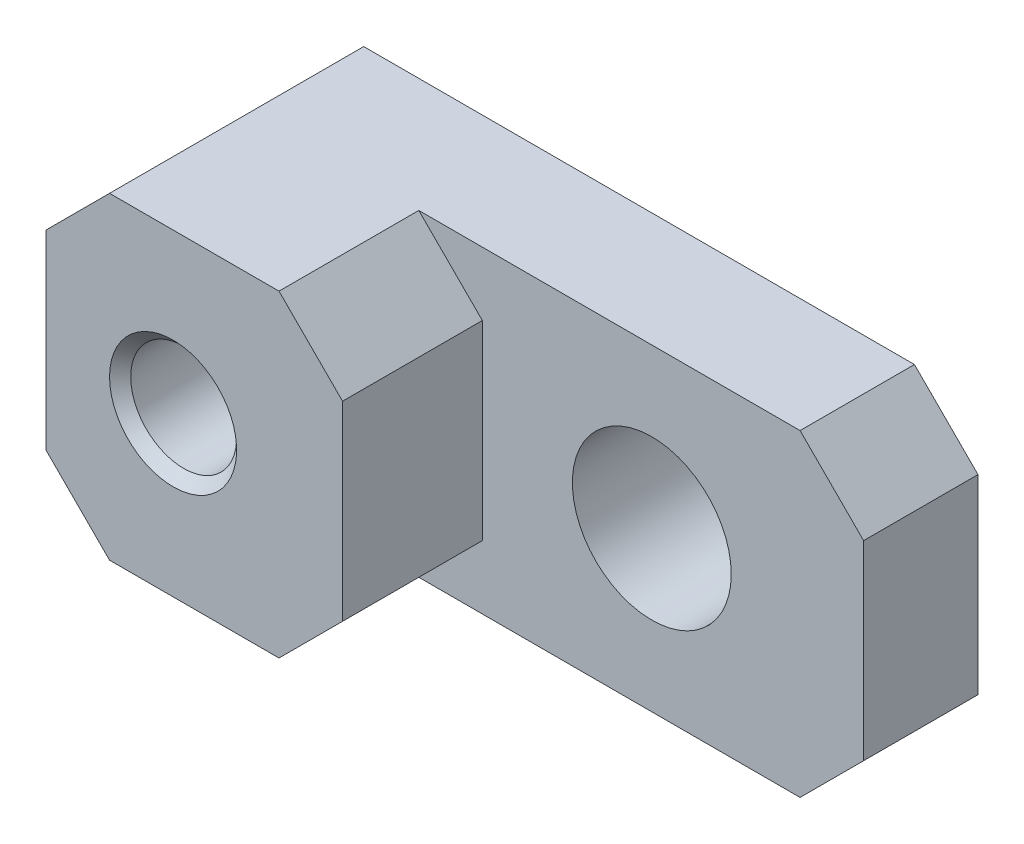
ISO-10303-21;
HEADER;
FILE_DESCRIPTION(('STEP AP214'),'2;1');
FILE_NAME('part.step','',(''),(''),'','','');
FILE_SCHEMA(('AUTOMOTIVE_DESIGN { 1 0 10303 214 1 1 1 1 }'));
ENDSEC;
DATA;
#1=APPLICATION_CONTEXT('core data for automotive mechanical design processes');
#2=APPLICATION_PROTOCOL_DEFINITION('international standard','automotive_design',2000,#1);
#3=PRODUCT_CONTEXT('',#1,'mechanical');
#4=PRODUCT('Part','Part','',(#3));
#5=PRODUCT_RELATED_PRODUCT_CATEGORY('part','',(#4));
#6=PRODUCT_DEFINITION_FORMATION('','',#4);
#7=PRODUCT_DEFINITION_CONTEXT('part definition',#1,'design');
#8=PRODUCT_DEFINITION('design','',#6,#7);
#9=PRODUCT_DEFINITION_SHAPE('','',#8);
#10=(LENGTH_UNIT() NAMED_UNIT(*) SI_UNIT(.MILLI.,.METRE.));
#11=(NAMED_UNIT(*) PLANE_ANGLE_UNIT() SI_UNIT($,.RADIAN.));
#12=(NAMED_UNIT(*) SI_UNIT($,.STERADIAN.) SOLID_ANGLE_UNIT());
#13=UNCERTAINTY_MEASURE_WITH_UNIT(LENGTH_MEASURE(1.E-05),#10,'distance_accuracy_value','');
#14=(GEOMETRIC_REPRESENTATION_CONTEXT(3) GLOBAL_UNCERTAINTY_ASSIGNED_CONTEXT((#13)) GLOBAL_UNIT_ASSIGNED_CONTEXT((#10,
#11,#12)) REPRESENTATION_CONTEXT('',''));
#15=CARTESIAN_POINT('',(0.,0.,0.));
#16=DIRECTION('',(0.,0.,1.));
#17=DIRECTION('',(1.,0.,0.));
#18=AXIS2_PLACEMENT_3D('',#15,#16,#17);
#19=CARTESIAN_POINT('',(20.32,0.,7.62));
#20=DIRECTION('',(-1.,0.,0.));
#21=DIRECTION('',(0.,0.,1.));
#22=AXIS2_PLACEMENT_3D('',#19,#20,#21);
#23=PLANE('',#22);
#24=DIRECTION('',(0.,1.,0.));
#25=VECTOR('',#24,1.);
#26=CARTESIAN_POINT('',(20.32,0.,0.));
#27=LINE('',#26,#25);
#28=CARTESIAN_POINT('',(20.32,1.905,0.));
#29=VERTEX_POINT('',#28);
#30=CARTESIAN_POINT('',(20.32,7.62,0.));
#31=VERTEX_POINT('',#30);
#32=EDGE_CURVE('E176',#29,#31,#27,.T.);
#33=ORIENTED_EDGE('',*,*,#32,.T.);
#34=DIRECTION('',(0.,0.,1.));
#35=VECTOR('',#34,1.);
#36=CARTESIAN_POINT('',(20.32,7.62,7.62));
#37=LINE('',#36,#35);
#38=CARTESIAN_POINT('',(20.32,7.62000000000001,3.429));
#39=VERTEX_POINT('',#38);
#40=EDGE_CURVE('E47',#31,#39,#37,.T.);
#41=ORIENTED_EDGE('',*,*,#40,.T.);
#42=DIRECTION('',(0.,1.,0.));
#43=VECTOR('',#42,1.);
#44=CARTESIAN_POINT('',(20.32,0.,3.429));
#45=LINE('',#44,#43);
#46=CARTESIAN_POINT('',(20.32,1.905,3.429));
#47=VERTEX_POINT('',#46);
#48=EDGE_CURVE('E139',#47,#39,#45,.T.);
#49=ORIENTED_EDGE('',*,*,#48,.F.);
#50=DIRECTION('',(0.,0.,-1.));
#51=VECTOR('',#50,1.);
#52=CARTESIAN_POINT('',(20.32,1.905,7.62));
#53=LINE('',#52,#51);
#54=EDGE_CURVE('E145',#47,#29,#53,.T.);
#55=ORIENTED_EDGE('',*,*,#54,.T.);
#56=EDGE_LOOP('',(#33,#41,#49,#55));
#57=FACE_BOUND('',#56,.T.);
#58=ADVANCED_FACE('F32',(#57),#23,.F.);
#59=CARTESIAN_POINT('',(13.97,4.7625,7.62));
#60=DIRECTION('',(0.,0.,1.));
#61=DIRECTION('',(1.,0.,0.));
#62=AXIS2_PLACEMENT_3D('',#59,#60,#61);
#63=CYLINDRICAL_SURFACE('',#62,2.38125);
#64=CARTESIAN_POINT('',(13.97,4.7625,0.));
#65=DIRECTION('',(0.,0.,1.));
#66=DIRECTION('',(1.,0.,0.));
#67=AXIS2_PLACEMENT_3D('',#64,#65,#66);
#68=CIRCLE('',#67,2.38125);
#69=CARTESIAN_POINT('',(16.35125,4.7625,0.));
#70=VERTEX_POINT('',#69);
#71=EDGE_CURVE('E174',#70,#70,#68,.T.);
#72=ORIENTED_EDGE('',*,*,#71,.F.);
#73=EDGE_LOOP('',(#72));
#74=FACE_BOUND('',#73,.T.);
#75=CARTESIAN_POINT('',(13.97,4.7625,3.429));
#76=DIRECTION('',(0.,0.,1.));
#77=DIRECTION('',(1.,0.,0.));
#78=AXIS2_PLACEMENT_3D('',#75,#76,#77);
#79=CIRCLE('',#78,2.38125);
#80=CARTESIAN_POINT('',(16.35125,4.7625,3.429));
#81=VERTEX_POINT('',#80);
#82=EDGE_CURVE('E179',#81,#81,#79,.F.);
#83=ORIENTED_EDGE('',*,*,#82,.F.);
#84=EDGE_LOOP('',(#83));
#85=FACE_BOUND('',#84,.T.);
#86=ADVANCED_FACE('F258',(#74,#85),#63,.F.);
#87=CARTESIAN_POINT('',(0.,0.,7.62));
#88=DIRECTION('',(1.,0.,0.));
#89=DIRECTION('',(0.,0.,-1.));
#90=AXIS2_PLACEMENT_3D('',#87,#88,#89);
#91=PLANE('',#90);
#92=DIRECTION('',(0.,-1.,0.));
#93=VECTOR('',#92,1.);
#94=CARTESIAN_POINT('',(0.,0.,7.62));
#95=LINE('',#94,#93);
#96=CARTESIAN_POINT('',(0.,7.62,7.62));
#97=VERTEX_POINT('',#96);
#98=CARTESIAN_POINT('',(0.,1.90500000000001,7.62));
#99=VERTEX_POINT('',#98);
#100=EDGE_CURVE('E165',#97,#99,#95,.T.);
#101=ORIENTED_EDGE('',*,*,#100,.F.);
#102=DIRECTION('',(0.,0.,-1.));
#103=VECTOR('',#102,1.);
#104=CARTESIAN_POINT('',(0.,7.62,7.62));
#105=LINE('',#104,#103);
#106=CARTESIAN_POINT('',(0.,7.62,0.));
#107=VERTEX_POINT('',#106);
#108=EDGE_CURVE('E154',#97,#107,#105,.T.);
#109=ORIENTED_EDGE('',*,*,#108,.T.);
#110=DIRECTION('',(0.,-1.,0.));
#111=VECTOR('',#110,1.);
#112=CARTESIAN_POINT('',(0.,0.,0.));
#113=LINE('',#112,#111);
#114=CARTESIAN_POINT('',(0.,1.90500000000001,0.));
#115=VERTEX_POINT('',#114);
#116=EDGE_CURVE('E162',#107,#115,#113,.T.);
#117=ORIENTED_EDGE('',*,*,#116,.T.);
#118=DIRECTION('',(0.,0.,1.));
#119=VECTOR('',#118,1.);
#120=CARTESIAN_POINT('',(0.,1.90500000000001,7.62));
#121=LINE('',#120,#119);
#122=EDGE_CURVE('E148',#115,#99,#121,.T.);
#123=ORIENTED_EDGE('',*,*,#122,.T.);
#124=EDGE_LOOP('',(#101,#109,#117,#123));
#125=FACE_BOUND('',#124,.T.);
#126=ADVANCED_FACE('F161',(#125),#91,.F.);
#127=CARTESIAN_POINT('',(0.,0.,7.62));
#128=DIRECTION('',(0.,1.,0.));
#129=DIRECTION('',(0.,0.,1.));
#130=AXIS2_PLACEMENT_3D('',#127,#128,#129);
#131=PLANE('',#130);
#132=DIRECTION('',(1.,0.,0.));
#133=VECTOR('',#132,1.);
#134=CARTESIAN_POINT('',(8.89,0.,3.429));
#135=LINE('',#134,#133);
#136=CARTESIAN_POINT('',(6.985,0.,3.429));
#137=VERTEX_POINT('',#136);
#138=CARTESIAN_POINT('',(18.415,0.,3.429));
#139=VERTEX_POINT('',#138);
#140=EDGE_CURVE('E125',#137,#139,#135,.T.);
#141=ORIENTED_EDGE('',*,*,#140,.F.);
#142=DIRECTION('',(0.,0.,1.));
#143=VECTOR('',#142,1.);
#144=CARTESIAN_POINT('',(6.985,0.,7.62));
#145=LINE('',#144,#143);
#146=CARTESIAN_POINT('',(6.985,0.,7.62));
#147=VERTEX_POINT('',#146);
#148=EDGE_CURVE('E131',#137,#147,#145,.T.);
#149=ORIENTED_EDGE('',*,*,#148,.T.);
#150=DIRECTION('',(1.,0.,0.));
#151=VECTOR('',#150,1.);
#152=CARTESIAN_POINT('',(0.,0.,7.62));
#153=LINE('',#152,#151);
#154=CARTESIAN_POINT('',(1.905,0.,7.62));
#155=VERTEX_POINT('',#154);
#156=EDGE_CURVE('E241',#155,#147,#153,.T.);
#157=ORIENTED_EDGE('',*,*,#156,.F.);
#158=DIRECTION('',(0.,0.,-1.));
#159=VECTOR('',#158,1.);
#160=CARTESIAN_POINT('',(1.905,0.,7.62));
#161=LINE('',#160,#159);
#162=CARTESIAN_POINT('',(1.905,0.,0.));
#163=VERTEX_POINT('',#162);
#164=EDGE_CURVE('E132',#155,#163,#161,.T.);
#165=ORIENTED_EDGE('',*,*,#164,.T.);
#166=DIRECTION('',(1.,0.,0.));
#167=VECTOR('',#166,1.);
#168=CARTESIAN_POINT('',(0.,0.,0.));
#169=LINE('',#168,#167);
#170=CARTESIAN_POINT('',(18.415,0.,0.));
#171=VERTEX_POINT('',#170);
#172=EDGE_CURVE('E129',#163,#171,#169,.T.);
#173=ORIENTED_EDGE('',*,*,#172,.T.);
#174=DIRECTION('',(0.,0.,1.));
#175=VECTOR('',#174,1.);
#176=CARTESIAN_POINT('',(18.415,0.,7.62));
#177=LINE('',#176,#175);
#178=EDGE_CURVE('E122',#171,#139,#177,.T.);
#179=ORIENTED_EDGE('',*,*,#178,.T.);
#180=EDGE_LOOP('',(#141,#149,#157,#165,#173,#179));
#181=FACE_BOUND('',#180,.T.);
#182=ADVANCED_FACE('F123',(#181),#131,.F.);
#183=CARTESIAN_POINT('',(0.,9.525,7.62));
#184=DIRECTION('',(0.,-1.,0.));
#185=DIRECTION('',(0.,0.,-1.));
#186=AXIS2_PLACEMENT_3D('',#183,#184,#185);
#187=PLANE('',#186);
#188=DIRECTION('',(-1.,0.,0.));
#189=VECTOR('',#188,1.);
#190=CARTESIAN_POINT('',(0.,9.525,7.62));
#191=LINE('',#190,#189);
#192=CARTESIAN_POINT('',(6.98499999999999,9.525,7.62));
#193=VERTEX_POINT('',#192);
#194=CARTESIAN_POINT('',(1.90500000000001,9.525,7.62));
#195=VERTEX_POINT('',#194);
#196=EDGE_CURVE('E182',#193,#195,#191,.T.);
#197=ORIENTED_EDGE('',*,*,#196,.F.);
#198=DIRECTION('',(0.,0.,-1.));
#199=VECTOR('',#198,1.);
#200=CARTESIAN_POINT('',(6.98499999999999,9.525,7.62));
#201=LINE('',#200,#199);
#202=CARTESIAN_POINT('',(6.98499999999999,9.525,3.429));
#203=VERTEX_POINT('',#202);
#204=EDGE_CURVE('E210',#193,#203,#201,.T.);
#205=ORIENTED_EDGE('',*,*,#204,.T.);
#206=DIRECTION('',(-1.,0.,0.));
#207=VECTOR('',#206,1.);
#208=CARTESIAN_POINT('',(20.32,9.525,3.429));
#209=LINE('',#208,#207);
#210=CARTESIAN_POINT('',(18.415,9.525,3.429));
#211=VERTEX_POINT('',#210);
#212=EDGE_CURVE('E228',#211,#203,#209,.T.);
#213=ORIENTED_EDGE('',*,*,#212,.F.);
#214=DIRECTION('',(0.,0.,-1.));
#215=VECTOR('',#214,1.);
#216=CARTESIAN_POINT('',(18.415,9.525,7.62));
#217=LINE('',#216,#215);
#218=CARTESIAN_POINT('',(18.415,9.525,0.));
#219=VERTEX_POINT('',#218);
#220=EDGE_CURVE('E207',#211,#219,#217,.T.);
#221=ORIENTED_EDGE('',*,*,#220,.T.);
#222=DIRECTION('',(-1.,0.,0.));
#223=VECTOR('',#222,1.);
#224=CARTESIAN_POINT('',(0.,9.525,0.));
#225=LINE('',#224,#223);
#226=CARTESIAN_POINT('',(1.90500000000001,9.525,0.));
#227=VERTEX_POINT('',#226);
#228=EDGE_CURVE('E186',#219,#227,#225,.T.);
#229=ORIENTED_EDGE('',*,*,#228,.T.);
#230=DIRECTION('',(0.,0.,1.));
#231=VECTOR('',#230,1.);
#232=CARTESIAN_POINT('',(1.90500000000001,9.525,7.62));
#233=LINE('',#232,#231);
#234=EDGE_CURVE('E205',#227,#195,#233,.T.);
#235=ORIENTED_EDGE('',*,*,#234,.T.);
#236=EDGE_LOOP('',(#197,#205,#213,#221,#229,#235));
#237=FACE_BOUND('',#236,.T.);
#238=ADVANCED_FACE('F226',(#237),#187,.F.);
#239=CARTESIAN_POINT('',(0.,9.525,7.62));
#240=DIRECTION('',(0.,0.,-1.));
#241=DIRECTION('',(-1.,0.,0.));
#242=AXIS2_PLACEMENT_3D('',#239,#240,#241);
#243=PLANE('',#242);
#244=CARTESIAN_POINT('',(3.81,4.7625,7.62));
#245=DIRECTION('',(0.,0.,-1.));
#246=DIRECTION('',(-1.,0.,0.));
#247=AXIS2_PLACEMENT_3D('',#244,#245,#246);
#248=CIRCLE('',#247,1.905);
#249=CARTESIAN_POINT('',(1.905,4.7625,7.62));
#250=VERTEX_POINT('',#249);
#251=EDGE_CURVE('E235',#250,#250,#248,.T.);
#252=ORIENTED_EDGE('',*,*,#251,.T.);
#253=EDGE_LOOP('',(#252));
#254=FACE_BOUND('',#253,.T.);
#255=ORIENTED_EDGE('',*,*,#156,.T.);
#256=DIRECTION('',(-0.707106781186546,-0.707106781186549,0.));
#257=VECTOR('',#256,1.);
#258=CARTESIAN_POINT('',(6.985,0.,7.62));
#259=LINE('',#258,#257);
#260=CARTESIAN_POINT('',(8.89,1.90500000000001,7.62));
#261=VERTEX_POINT('',#260);
#262=EDGE_CURVE('E198',#147,#261,#259,.F.);
#263=ORIENTED_EDGE('',*,*,#262,.T.);
#264=DIRECTION('',(0.,-1.,0.));
#265=VECTOR('',#264,1.);
#266=CARTESIAN_POINT('',(8.89,9.525,7.62));
#267=LINE('',#266,#265);
#268=CARTESIAN_POINT('',(8.89,7.62,7.62));
#269=VERTEX_POINT('',#268);
#270=EDGE_CURVE('E231',#269,#261,#267,.T.);
#271=ORIENTED_EDGE('',*,*,#270,.F.);
#272=DIRECTION('',(0.707106781186549,-0.707106781186546,0.));
#273=VECTOR('',#272,1.);
#274=CARTESIAN_POINT('',(8.89,7.62,7.62));
#275=LINE('',#274,#273);
#276=EDGE_CURVE('E196',#269,#193,#275,.F.);
#277=ORIENTED_EDGE('',*,*,#276,.T.);
#278=ORIENTED_EDGE('',*,*,#196,.T.);
#279=DIRECTION('',(0.707106781186549,0.707106781186546,0.));
#280=VECTOR('',#279,1.);
#281=CARTESIAN_POINT('',(0.,7.62,7.62));
#282=LINE('',#281,#280);
#283=EDGE_CURVE('E194',#195,#97,#282,.F.);
#284=ORIENTED_EDGE('',*,*,#283,.T.);
#285=ORIENTED_EDGE('',*,*,#100,.T.);
#286=DIRECTION('',(-0.707106781186546,0.707106781186549,0.));
#287=VECTOR('',#286,1.);
#288=CARTESIAN_POINT('',(1.905,0.,7.62));
#289=LINE('',#288,#287);
#290=EDGE_CURVE('E192',#99,#155,#289,.F.);
#291=ORIENTED_EDGE('',*,*,#290,.T.);
#292=EDGE_LOOP('',(#255,#263,#271,#277,#278,#284,#285,#291));
#293=FACE_BOUND('',#292,.T.);
#294=ADVANCED_FACE('F246',(#254,#293),#243,.F.);
#295=CARTESIAN_POINT('',(0.,9.525,0.));
#296=DIRECTION('',(0.,0.,-1.));
#297=DIRECTION('',(-1.,0.,0.));
#298=AXIS2_PLACEMENT_3D('',#295,#296,#297);
#299=PLANE('',#298);
#300=CARTESIAN_POINT('',(3.81,4.7625,0.));
#301=DIRECTION('',(0.,0.,-1.));
#302=DIRECTION('',(-1.,0.,0.));
#303=AXIS2_PLACEMENT_3D('',#300,#301,#302);
#304=CIRCLE('',#303,1.905);
#305=CARTESIAN_POINT('',(1.905,4.7625,0.));
#306=VERTEX_POINT('',#305);
#307=EDGE_CURVE('E439',#306,#306,#304,.T.);
#308=ORIENTED_EDGE('',*,*,#307,.F.);
#309=EDGE_LOOP('',(#308));
#310=FACE_BOUND('',#309,.T.);
#311=ORIENTED_EDGE('',*,*,#71,.T.);
#312=EDGE_LOOP('',(#311));
#313=FACE_BOUND('',#312,.T.);
#314=ORIENTED_EDGE('',*,*,#228,.F.);
#315=DIRECTION('',(-0.707106781186547,0.707106781186548,0.));
#316=VECTOR('',#315,1.);
#317=CARTESIAN_POINT('',(9.20750000000002,18.7325,0.));
#318=LINE('',#317,#316);
#319=EDGE_CURVE('E217',#219,#31,#318,.F.);
#320=ORIENTED_EDGE('',*,*,#319,.T.);
#321=ORIENTED_EDGE('',*,*,#32,.F.);
#322=DIRECTION('',(0.70710678118655,0.707106781186545,0.));
#323=VECTOR('',#322,1.);
#324=CARTESIAN_POINT('',(13.9699999999999,-4.44500000000002,0.));
#325=LINE('',#324,#323);
#326=EDGE_CURVE('E215',#29,#171,#325,.F.);
#327=ORIENTED_EDGE('',*,*,#326,.T.);
#328=ORIENTED_EDGE('',*,*,#172,.F.);
#329=DIRECTION('',(0.707106781186546,-0.707106781186549,0.));
#330=VECTOR('',#329,1.);
#331=CARTESIAN_POINT('',(-3.81,5.71500000000002,0.));
#332=LINE('',#331,#330);
#333=EDGE_CURVE('E173',#163,#115,#332,.F.);
#334=ORIENTED_EDGE('',*,*,#333,.T.);
#335=ORIENTED_EDGE('',*,*,#116,.F.);
#336=DIRECTION('',(-0.707106781186549,-0.707106781186546,0.));
#337=VECTOR('',#336,1.);
#338=CARTESIAN_POINT('',(0.9525,8.5725,0.));
#339=LINE('',#338,#337);
#340=EDGE_CURVE('E171',#107,#227,#339,.F.);
#341=ORIENTED_EDGE('',*,*,#340,.T.);
#342=EDGE_LOOP('',(#314,#320,#321,#327,#328,#334,#335,#341));
#343=FACE_BOUND('',#342,.T.);
#344=ADVANCED_FACE('F170',(#310,#313,#343),#299,.T.);
#345=CARTESIAN_POINT('',(8.89,9.525,3.429));
#346=DIRECTION('',(0.,0.,1.));
#347=DIRECTION('',(1.,0.,0.));
#348=AXIS2_PLACEMENT_3D('',#345,#346,#347);
#349=PLANE('',#348);
#350=ORIENTED_EDGE('',*,*,#48,.T.);
#351=DIRECTION('',(0.707106781186547,-0.707106781186548,0.));
#352=VECTOR('',#351,1.);
#353=CARTESIAN_POINT('',(13.6525,14.2875,3.429));
#354=LINE('',#353,#352);
#355=EDGE_CURVE('E146',#39,#211,#354,.F.);
#356=ORIENTED_EDGE('',*,*,#355,.T.);
#357=ORIENTED_EDGE('',*,*,#212,.T.);
#358=DIRECTION('',(-0.707106781186549,0.707106781186546,0.));
#359=VECTOR('',#358,1.);
#360=CARTESIAN_POINT('',(8.89,7.62,3.429));
#361=LINE('',#360,#359);
#362=CARTESIAN_POINT('',(8.89,7.62,3.429));
#363=VERTEX_POINT('',#362);
#364=EDGE_CURVE('E11',#203,#363,#361,.F.);
#365=ORIENTED_EDGE('',*,*,#364,.T.);
#366=DIRECTION('',(0.,-1.,0.));
#367=VECTOR('',#366,1.);
#368=CARTESIAN_POINT('',(8.89,9.525,3.429));
#369=LINE('',#368,#367);
#370=CARTESIAN_POINT('',(8.89,1.90500000000001,3.429));
#371=VERTEX_POINT('',#370);
#372=EDGE_CURVE('E140',#363,#371,#369,.T.);
#373=ORIENTED_EDGE('',*,*,#372,.T.);
#374=DIRECTION('',(0.707106781186546,0.707106781186549,0.));
#375=VECTOR('',#374,1.);
#376=CARTESIAN_POINT('',(6.985,0.,3.429));
#377=LINE('',#376,#375);
#378=EDGE_CURVE('E40',#371,#137,#377,.F.);
#379=ORIENTED_EDGE('',*,*,#378,.T.);
#380=ORIENTED_EDGE('',*,*,#140,.T.);
#381=DIRECTION('',(-0.70710678118655,-0.707106781186545,0.));
#382=VECTOR('',#381,1.);
#383=CARTESIAN_POINT('',(18.415,0.,3.429));
#384=LINE('',#383,#382);
#385=EDGE_CURVE('E54',#139,#47,#384,.F.);
#386=ORIENTED_EDGE('',*,*,#385,.T.);
#387=EDGE_LOOP('',(#350,#356,#357,#365,#373,#379,#380,#386));
#388=FACE_BOUND('',#387,.T.);
#389=ORIENTED_EDGE('',*,*,#82,.T.);
#390=EDGE_LOOP('',(#389));
#391=FACE_BOUND('',#390,.T.);
#392=ADVANCED_FACE('F134',(#388,#391),#349,.T.);
#393=CARTESIAN_POINT('',(8.89,9.525,3.429));
#394=DIRECTION('',(-1.,0.,0.));
#395=DIRECTION('',(0.,-1.,0.));
#396=AXIS2_PLACEMENT_3D('',#393,#394,#395);
#397=PLANE('',#396);
#398=ORIENTED_EDGE('',*,*,#270,.T.);
#399=DIRECTION('',(0.,0.,-1.));
#400=VECTOR('',#399,1.);
#401=CARTESIAN_POINT('',(8.89,1.90500000000001,3.429));
#402=LINE('',#401,#400);
#403=EDGE_CURVE('E203',#261,#371,#402,.T.);
#404=ORIENTED_EDGE('',*,*,#403,.T.);
#405=ORIENTED_EDGE('',*,*,#372,.F.);
#406=DIRECTION('',(0.,0.,1.));
#407=VECTOR('',#406,1.);
#408=CARTESIAN_POINT('',(8.89,7.62,3.429));
#409=LINE('',#408,#407);
#410=EDGE_CURVE('E200',#363,#269,#409,.T.);
#411=ORIENTED_EDGE('',*,*,#410,.T.);
#412=EDGE_LOOP('',(#398,#404,#405,#411));
#413=FACE_BOUND('',#412,.T.);
#414=ADVANCED_FACE('F276',(#413),#397,.F.);
#415=CARTESIAN_POINT('',(6.985,0.,7.62));
#416=DIRECTION('',(-0.707106781186549,0.707106781186546,0.));
#417=DIRECTION('',(-0.707106781186546,-0.707106781186549,0.));
#418=AXIS2_PLACEMENT_3D('',#415,#416,#417);
#419=PLANE('',#418);
#420=ORIENTED_EDGE('',*,*,#378,.F.);
#421=ORIENTED_EDGE('',*,*,#403,.F.);
#422=ORIENTED_EDGE('',*,*,#262,.F.);
#423=ORIENTED_EDGE('',*,*,#148,.F.);
#424=EDGE_LOOP('',(#420,#421,#422,#423));
#425=FACE_BOUND('',#424,.T.);
#426=ADVANCED_FACE('F272',(#425),#419,.F.);
#427=CARTESIAN_POINT('',(8.89,7.62,3.429));
#428=DIRECTION('',(-0.707106781186546,-0.707106781186549,0.));
#429=DIRECTION('',(0.707106781186549,-0.707106781186546,0.));
#430=AXIS2_PLACEMENT_3D('',#427,#428,#429);
#431=PLANE('',#430);
#432=ORIENTED_EDGE('',*,*,#364,.F.);
#433=ORIENTED_EDGE('',*,*,#204,.F.);
#434=ORIENTED_EDGE('',*,*,#276,.F.);
#435=ORIENTED_EDGE('',*,*,#410,.F.);
#436=EDGE_LOOP('',(#432,#433,#434,#435));
#437=FACE_BOUND('',#436,.T.);
#438=ADVANCED_FACE('F275',(#437),#431,.F.);
#439=CARTESIAN_POINT('',(18.415,9.525,7.62));
#440=DIRECTION('',(-0.707106781186548,-0.707106781186547,0.));
#441=DIRECTION('',(0.707106781186547,-0.707106781186548,0.));
#442=AXIS2_PLACEMENT_3D('',#439,#440,#441);
#443=PLANE('',#442);
#444=ORIENTED_EDGE('',*,*,#355,.F.);
#445=ORIENTED_EDGE('',*,*,#40,.F.);
#446=ORIENTED_EDGE('',*,*,#319,.F.);
#447=ORIENTED_EDGE('',*,*,#220,.F.);
#448=EDGE_LOOP('',(#444,#445,#446,#447));
#449=FACE_BOUND('',#448,.T.);
#450=ADVANCED_FACE('F222',(#449),#443,.F.);
#451=CARTESIAN_POINT('',(20.32,1.905,7.62));
#452=DIRECTION('',(-0.707106781186545,0.70710678118655,0.));
#453=DIRECTION('',(-0.70710678118655,-0.707106781186545,0.));
#454=AXIS2_PLACEMENT_3D('',#451,#452,#453);
#455=PLANE('',#454);
#456=ORIENTED_EDGE('',*,*,#385,.F.);
#457=ORIENTED_EDGE('',*,*,#178,.F.);
#458=ORIENTED_EDGE('',*,*,#326,.F.);
#459=ORIENTED_EDGE('',*,*,#54,.F.);
#460=EDGE_LOOP('',(#456,#457,#458,#459));
#461=FACE_BOUND('',#460,.T.);
#462=ADVANCED_FACE('F143',(#461),#455,.F.);
#463=CARTESIAN_POINT('',(0.,7.62,7.62));
#464=DIRECTION('',(0.707106781186546,-0.707106781186549,0.));
#465=DIRECTION('',(0.707106781186549,0.707106781186546,0.));
#466=AXIS2_PLACEMENT_3D('',#463,#464,#465);
#467=PLANE('',#466);
#468=ORIENTED_EDGE('',*,*,#283,.F.);
#469=ORIENTED_EDGE('',*,*,#234,.F.);
#470=ORIENTED_EDGE('',*,*,#340,.F.);
#471=ORIENTED_EDGE('',*,*,#108,.F.);
#472=EDGE_LOOP('',(#468,#469,#470,#471));
#473=FACE_BOUND('',#472,.T.);
#474=ADVANCED_FACE('F248',(#473),#467,.F.);
#475=CARTESIAN_POINT('',(1.905,0.,7.62));
#476=DIRECTION('',(0.707106781186549,0.707106781186546,0.));
#477=DIRECTION('',(-0.707106781186546,0.707106781186549,0.));
#478=AXIS2_PLACEMENT_3D('',#475,#476,#477);
#479=PLANE('',#478);
#480=ORIENTED_EDGE('',*,*,#290,.F.);
#481=ORIENTED_EDGE('',*,*,#122,.F.);
#482=ORIENTED_EDGE('',*,*,#333,.F.);
#483=ORIENTED_EDGE('',*,*,#164,.F.);
#484=EDGE_LOOP('',(#480,#481,#482,#483));
#485=FACE_BOUND('',#484,.T.);
#486=ADVANCED_FACE('F34',(#485),#479,.F.);
#487=CARTESIAN_POINT('',(3.81,4.7625,7.3025));
#488=DIRECTION('',(0.,0.,1.));
#489=DIRECTION('',(1.,0.,0.));
#490=AXIS2_PLACEMENT_3D('',#487,#488,#489);
#491=CONICAL_SURFACE('',#490,1.5875,0.78539816339745);
#492=ORIENTED_EDGE('',*,*,#251,.F.);
#493=EDGE_LOOP('',(#492));
#494=FACE_BOUND('',#493,.T.);
#495=CARTESIAN_POINT('',(3.81,4.7625,7.3025));
#496=DIRECTION('',(0.,0.,-1.));
#497=DIRECTION('',(-1.,0.,0.));
#498=AXIS2_PLACEMENT_3D('',#495,#496,#497);
#499=CIRCLE('',#498,1.5875);
#500=CARTESIAN_POINT('',(2.2225,4.7625,7.3025));
#501=VERTEX_POINT('',#500);
#502=EDGE_CURVE('E448',#501,#501,#499,.T.);
#503=ORIENTED_EDGE('',*,*,#502,.T.);
#504=EDGE_LOOP('',(#503));
#505=FACE_BOUND('',#504,.T.);
#506=ADVANCED_FACE('F254',(#494,#505),#491,.F.);
#507=CARTESIAN_POINT('',(3.81,4.7625,0.));
#508=DIRECTION('',(0.,0.,-1.));
#509=DIRECTION('',(-1.,0.,0.));
#510=AXIS2_PLACEMENT_3D('',#507,#508,#509);
#511=CYLINDRICAL_SURFACE('',#510,1.5875);
#512=ORIENTED_EDGE('',*,*,#502,.F.);
#513=EDGE_LOOP('',(#512));
#514=FACE_BOUND('',#513,.T.);
#515=CARTESIAN_POINT('',(3.81,4.7625,1.524));
#516=DIRECTION('',(0.,0.,-1.));
#517=DIRECTION('',(-1.,0.,0.));
#518=AXIS2_PLACEMENT_3D('',#515,#516,#517);
#519=CIRCLE('',#518,1.5875);
#520=CARTESIAN_POINT('',(2.2225,4.7625,1.524));
#521=VERTEX_POINT('',#520);
#522=EDGE_CURVE('E446',#521,#521,#519,.T.);
#523=ORIENTED_EDGE('',*,*,#522,.T.);
#524=EDGE_LOOP('',(#523));
#525=FACE_BOUND('',#524,.T.);
#526=ADVANCED_FACE('F330',(#514,#525),#511,.F.);
#527=CARTESIAN_POINT('',(5.4102,4.7625,1.524));
#528=DIRECTION('',(0.,0.,1.));
#529=DIRECTION('',(1.,0.,0.));
#530=AXIS2_PLACEMENT_3D('',#527,#528,#529);
#531=PLANE('',#530);
#532=ORIENTED_EDGE('',*,*,#522,.F.);
#533=EDGE_LOOP('',(#532));
#534=FACE_BOUND('',#533,.T.);
#535=CARTESIAN_POINT('',(3.81,4.7625,1.524));
#536=DIRECTION('',(0.,0.,-1.));
#537=DIRECTION('',(-1.,0.,0.));
#538=AXIS2_PLACEMENT_3D('',#535,#536,#537);
#539=CIRCLE('',#538,1.6002);
#540=CARTESIAN_POINT('',(2.2098,4.7625,1.524));
#541=VERTEX_POINT('',#540);
#542=EDGE_CURVE('E441',#541,#541,#539,.T.);
#543=ORIENTED_EDGE('',*,*,#542,.T.);
#544=EDGE_LOOP('',(#543));
#545=FACE_BOUND('',#544,.T.);
#546=ADVANCED_FACE('F340',(#534,#545),#531,.F.);
#547=CARTESIAN_POINT('',(3.81,4.7625,0.));
#548=DIRECTION('',(0.,0.,-1.));
#549=DIRECTION('',(-1.,0.,0.));
#550=AXIS2_PLACEMENT_3D('',#547,#548,#549);
#551=CYLINDRICAL_SURFACE('',#550,1.6002);
#552=ORIENTED_EDGE('',*,*,#542,.F.);
#553=EDGE_LOOP('',(#552));
#554=FACE_BOUND('',#553,.T.);
#555=CARTESIAN_POINT('',(3.81,4.7625,0.3048));
#556=DIRECTION('',(0.,0.,-1.));
#557=DIRECTION('',(-1.,0.,0.));
#558=AXIS2_PLACEMENT_3D('',#555,#556,#557);
#559=CIRCLE('',#558,1.6002);
#560=CARTESIAN_POINT('',(2.2098,4.7625,0.3048));
#561=VERTEX_POINT('',#560);
#562=EDGE_CURVE('E436',#561,#561,#559,.T.);
#563=ORIENTED_EDGE('',*,*,#562,.T.);
#564=EDGE_LOOP('',(#563));
#565=FACE_BOUND('',#564,.T.);
#566=ADVANCED_FACE('F350',(#554,#565),#551,.F.);
#567=CARTESIAN_POINT('',(3.81,4.7625,0.));
#568=DIRECTION('',(0.,0.,-1.));
#569=DIRECTION('',(-1.,0.,0.));
#570=AXIS2_PLACEMENT_3D('',#567,#568,#569);
#571=CONICAL_SURFACE('',#570,1.905,0.785398163397449);
#572=ORIENTED_EDGE('',*,*,#562,.F.);
#573=EDGE_LOOP('',(#572));
#574=FACE_BOUND('',#573,.T.);
#575=ORIENTED_EDGE('',*,*,#307,.T.);
#576=EDGE_LOOP('',(#575));
#577=FACE_BOUND('',#576,.T.);
#578=ADVANCED_FACE('F360',(#574,#577),#571,.F.);
#579=CLOSED_SHELL('',(#58,#86,#126,#182,#238,#294,#344,#392,#414,#426,#438,#450,#462,#474,#486,
#506,#526,#546,#566,#578));
#580=MANIFOLD_SOLID_BREP('B2',#579);
#581=ADVANCED_BREP_SHAPE_REPRESENTATION('',(#18,#580),#14);
#582=SHAPE_DEFINITION_REPRESENTATION(#9,#581);
ENDSEC;
END-ISO-10303-21;
